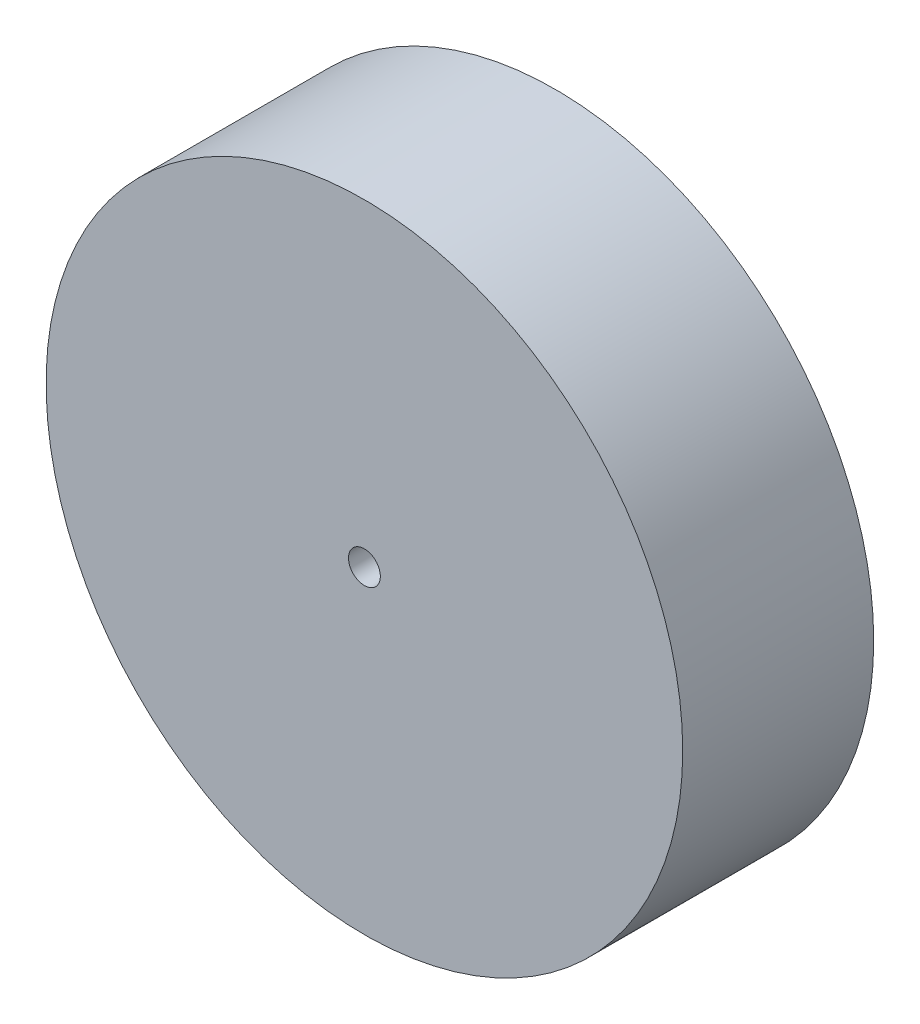
ISO-10303-21;
HEADER;
FILE_DESCRIPTION(('STEP AP214'),'2;1');
FILE_NAME('part.step','',(''),(''),'','','');
FILE_SCHEMA(('AUTOMOTIVE_DESIGN { 1 0 10303 214 1 1 1 1 }'));
ENDSEC;
DATA;
#1=APPLICATION_CONTEXT('core data for automotive mechanical design processes');
#2=APPLICATION_PROTOCOL_DEFINITION('international standard','automotive_design',2000,#1);
#3=PRODUCT_CONTEXT('',#1,'mechanical');
#4=PRODUCT('Part','Part','',(#3));
#5=PRODUCT_RELATED_PRODUCT_CATEGORY('part','',(#4));
#6=PRODUCT_DEFINITION_FORMATION('','',#4);
#7=PRODUCT_DEFINITION_CONTEXT('part definition',#1,'design');
#8=PRODUCT_DEFINITION('design','',#6,#7);
#9=PRODUCT_DEFINITION_SHAPE('','',#8);
#10=(LENGTH_UNIT() NAMED_UNIT(*) SI_UNIT(.MILLI.,.METRE.));
#11=(NAMED_UNIT(*) PLANE_ANGLE_UNIT() SI_UNIT($,.RADIAN.));
#12=(NAMED_UNIT(*) SI_UNIT($,.STERADIAN.) SOLID_ANGLE_UNIT());
#13=UNCERTAINTY_MEASURE_WITH_UNIT(LENGTH_MEASURE(1.E-05),#10,'distance_accuracy_value','');
#14=(GEOMETRIC_REPRESENTATION_CONTEXT(3) GLOBAL_UNCERTAINTY_ASSIGNED_CONTEXT((#13)) GLOBAL_UNIT_ASSIGNED_CONTEXT((#10,
#11,#12)) REPRESENTATION_CONTEXT('',''));
#15=CARTESIAN_POINT('',(0.,0.,0.));
#16=DIRECTION('',(0.,0.,1.));
#17=DIRECTION('',(1.,0.,0.));
#18=AXIS2_PLACEMENT_3D('',#15,#16,#17);
#19=CARTESIAN_POINT('',(0.,0.,0.));
#20=DIRECTION('',(0.,0.,1.));
#21=DIRECTION('',(1.,0.,0.));
#22=AXIS2_PLACEMENT_3D('',#19,#20,#21);
#23=PLANE('',#22);
#24=CARTESIAN_POINT('',(0.,0.,0.));
#25=DIRECTION('',(0.,0.,1.));
#26=DIRECTION('',(1.,0.,0.));
#27=AXIS2_PLACEMENT_3D('',#24,#25,#26);
#28=CIRCLE('',#27,12.5);
#29=CARTESIAN_POINT('',(12.5,0.,0.));
#30=VERTEX_POINT('',#29);
#31=EDGE_CURVE('E55',#30,#30,#28,.F.);
#32=ORIENTED_EDGE('',*,*,#31,.T.);
#33=EDGE_LOOP('',(#32));
#34=FACE_BOUND('',#33,.T.);
#35=CARTESIAN_POINT('',(0.,0.,0.));
#36=DIRECTION('',(0.,0.,-1.));
#37=DIRECTION('',(-1.,0.,0.));
#38=AXIS2_PLACEMENT_3D('',#35,#36,#37);
#39=CIRCLE('',#38,2.5);
#40=CARTESIAN_POINT('',(-2.5,0.,0.));
#41=VERTEX_POINT('',#40);
#42=EDGE_CURVE('E49',#41,#41,#39,.T.);
#43=ORIENTED_EDGE('',*,*,#42,.F.);
#44=EDGE_LOOP('',(#43));
#45=FACE_BOUND('',#44,.T.);
#46=ADVANCED_FACE('F36',(#34,#45),#23,.F.);
#47=CARTESIAN_POINT('',(0.,0.,30.));
#48=DIRECTION('',(0.,0.,-1.));
#49=DIRECTION('',(-1.,0.,0.));
#50=AXIS2_PLACEMENT_3D('',#47,#48,#49);
#51=CYLINDRICAL_SURFACE('',#50,50.);
#52=CARTESIAN_POINT('',(0.,0.,30.));
#53=DIRECTION('',(0.,0.,1.));
#54=DIRECTION('',(1.,0.,0.));
#55=AXIS2_PLACEMENT_3D('',#52,#53,#54);
#56=CIRCLE('',#55,50.);
#57=CARTESIAN_POINT('',(50.,0.,30.));
#58=VERTEX_POINT('',#57);
#59=EDGE_CURVE('E10',#58,#58,#56,.T.);
#60=ORIENTED_EDGE('',*,*,#59,.F.);
#61=EDGE_LOOP('',(#60));
#62=FACE_BOUND('',#61,.T.);
#63=CARTESIAN_POINT('',(0.,0.,0.));
#64=DIRECTION('',(0.,0.,1.));
#65=DIRECTION('',(1.,0.,0.));
#66=AXIS2_PLACEMENT_3D('',#63,#64,#65);
#67=CIRCLE('',#66,50.);
#68=CARTESIAN_POINT('',(50.,0.,0.));
#69=VERTEX_POINT('',#68);
#70=EDGE_CURVE('E40',#69,#69,#67,.T.);
#71=ORIENTED_EDGE('',*,*,#70,.T.);
#72=EDGE_LOOP('',(#71));
#73=FACE_BOUND('',#72,.T.);
#74=ADVANCED_FACE('F38',(#62,#73),#51,.T.);
#75=CARTESIAN_POINT('',(0.,0.,30.));
#76=DIRECTION('',(0.,0.,1.));
#77=DIRECTION('',(1.,0.,0.));
#78=AXIS2_PLACEMENT_3D('',#75,#76,#77);
#79=PLANE('',#78);
#80=CARTESIAN_POINT('',(0.,0.,30.));
#81=DIRECTION('',(0.,0.,-1.));
#82=DIRECTION('',(-1.,0.,0.));
#83=AXIS2_PLACEMENT_3D('',#80,#81,#82);
#84=CIRCLE('',#83,2.5);
#85=CARTESIAN_POINT('',(-2.5,0.,30.));
#86=VERTEX_POINT('',#85);
#87=EDGE_CURVE('E47',#86,#86,#84,.T.);
#88=ORIENTED_EDGE('',*,*,#87,.T.);
#89=EDGE_LOOP('',(#88));
#90=FACE_BOUND('',#89,.T.);
#91=ORIENTED_EDGE('',*,*,#59,.T.);
#92=EDGE_LOOP('',(#91));
#93=FACE_BOUND('',#92,.T.);
#94=ADVANCED_FACE('F90',(#90,#93),#79,.T.);
#95=CARTESIAN_POINT('',(0.,0.,0.));
#96=DIRECTION('',(0.,0.,1.));
#97=DIRECTION('',(1.,0.,0.));
#98=AXIS2_PLACEMENT_3D('',#95,#96,#97);
#99=CIRCLE('',#98,40.);
#100=CARTESIAN_POINT('',(40.,0.,0.));
#101=VERTEX_POINT('',#100);
#102=EDGE_CURVE('E59',#101,#101,#99,.T.);
#103=ORIENTED_EDGE('',*,*,#102,.T.);
#104=EDGE_LOOP('',(#103));
#105=FACE_BOUND('',#104,.T.);
#106=ORIENTED_EDGE('',*,*,#70,.F.);
#107=EDGE_LOOP('',(#106));
#108=FACE_BOUND('',#107,.T.);
#109=ADVANCED_FACE('F86',(#105,#108),#23,.F.);
#110=CARTESIAN_POINT('',(0.,0.,30.));
#111=DIRECTION('',(0.,0.,-1.));
#112=DIRECTION('',(-1.,0.,0.));
#113=AXIS2_PLACEMENT_3D('',#110,#111,#112);
#114=CYLINDRICAL_SURFACE('',#113,2.5);
#115=ORIENTED_EDGE('',*,*,#87,.F.);
#116=EDGE_LOOP('',(#115));
#117=FACE_BOUND('',#116,.T.);
#118=ORIENTED_EDGE('',*,*,#42,.T.);
#119=EDGE_LOOP('',(#118));
#120=FACE_BOUND('',#119,.T.);
#121=ADVANCED_FACE('F81',(#117,#120),#114,.F.);
#122=CARTESIAN_POINT('',(0.,0.,30.));
#123=DIRECTION('',(0.,0.,-1.));
#124=DIRECTION('',(-1.,0.,0.));
#125=AXIS2_PLACEMENT_3D('',#122,#123,#124);
#126=CYLINDRICAL_SURFACE('',#125,40.);
#127=CARTESIAN_POINT('',(0.,0.,20.));
#128=DIRECTION('',(0.,0.,1.));
#129=DIRECTION('',(1.,0.,0.));
#130=AXIS2_PLACEMENT_3D('',#127,#128,#129);
#131=CIRCLE('',#130,40.);
#132=CARTESIAN_POINT('',(40.,0.,20.));
#133=VERTEX_POINT('',#132);
#134=EDGE_CURVE('E52',#133,#133,#131,.T.);
#135=ORIENTED_EDGE('',*,*,#134,.T.);
#136=EDGE_LOOP('',(#135));
#137=FACE_BOUND('',#136,.T.);
#138=ORIENTED_EDGE('',*,*,#102,.F.);
#139=EDGE_LOOP('',(#138));
#140=FACE_BOUND('',#139,.T.);
#141=ADVANCED_FACE('F67',(#137,#140),#126,.F.);
#142=CARTESIAN_POINT('',(0.,0.,20.));
#143=DIRECTION('',(0.,0.,1.));
#144=DIRECTION('',(1.,0.,0.));
#145=AXIS2_PLACEMENT_3D('',#142,#143,#144);
#146=PLANE('',#145);
#147=CARTESIAN_POINT('',(0.,0.,20.));
#148=DIRECTION('',(0.,0.,1.));
#149=DIRECTION('',(1.,0.,0.));
#150=AXIS2_PLACEMENT_3D('',#147,#148,#149);
#151=CIRCLE('',#150,12.5);
#152=CARTESIAN_POINT('',(12.5,0.,20.));
#153=VERTEX_POINT('',#152);
#154=EDGE_CURVE('E58',#153,#153,#151,.F.);
#155=ORIENTED_EDGE('',*,*,#154,.F.);
#156=EDGE_LOOP('',(#155));
#157=FACE_BOUND('',#156,.T.);
#158=ORIENTED_EDGE('',*,*,#134,.F.);
#159=EDGE_LOOP('',(#158));
#160=FACE_BOUND('',#159,.T.);
#161=ADVANCED_FACE('F70',(#157,#160),#146,.F.);
#162=CARTESIAN_POINT('',(0.,0.,30.));
#163=DIRECTION('',(0.,0.,-1.));
#164=DIRECTION('',(-1.,0.,0.));
#165=AXIS2_PLACEMENT_3D('',#162,#163,#164);
#166=CYLINDRICAL_SURFACE('',#165,12.5);
#167=ORIENTED_EDGE('',*,*,#154,.T.);
#168=EDGE_LOOP('',(#167));
#169=FACE_BOUND('',#168,.T.);
#170=ORIENTED_EDGE('',*,*,#31,.F.);
#171=EDGE_LOOP('',(#170));
#172=FACE_BOUND('',#171,.T.);
#173=ADVANCED_FACE('F72',(#169,#172),#166,.T.);
#174=CLOSED_SHELL('',(#46,#74,#94,#109,#121,#141,#161,#173));
#175=MANIFOLD_SOLID_BREP('B2',#174);
#176=ADVANCED_BREP_SHAPE_REPRESENTATION('',(#18,#175),#14);
#177=SHAPE_DEFINITION_REPRESENTATION(#9,#176);
ENDSEC;
END-ISO-10303-21;
